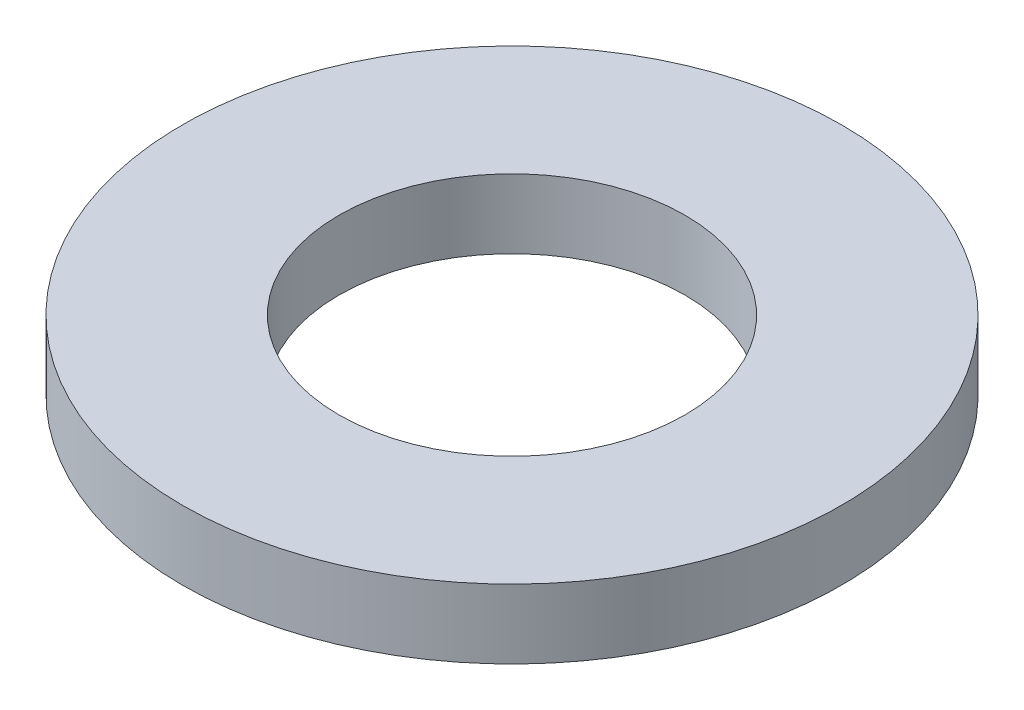
ISO-10303-21;
HEADER;
FILE_DESCRIPTION(('STEP AP214'),'2;1');
FILE_NAME('part.step','',(''),(''),'','','');
FILE_SCHEMA(('AUTOMOTIVE_DESIGN { 1 0 10303 214 1 1 1 1 }'));
ENDSEC;
DATA;
#1=APPLICATION_CONTEXT('core data for automotive mechanical design processes');
#2=APPLICATION_PROTOCOL_DEFINITION('international standard','automotive_design',2000,#1);
#3=PRODUCT_CONTEXT('',#1,'mechanical');
#4=PRODUCT('Part','Part','',(#3));
#5=PRODUCT_RELATED_PRODUCT_CATEGORY('part','',(#4));
#6=PRODUCT_DEFINITION_FORMATION('','',#4);
#7=PRODUCT_DEFINITION_CONTEXT('part definition',#1,'design');
#8=PRODUCT_DEFINITION('design','',#6,#7);
#9=PRODUCT_DEFINITION_SHAPE('','',#8);
#10=(LENGTH_UNIT() NAMED_UNIT(*) SI_UNIT(.MILLI.,.METRE.));
#11=(NAMED_UNIT(*) PLANE_ANGLE_UNIT() SI_UNIT($,.RADIAN.));
#12=(NAMED_UNIT(*) SI_UNIT($,.STERADIAN.) SOLID_ANGLE_UNIT());
#13=UNCERTAINTY_MEASURE_WITH_UNIT(LENGTH_MEASURE(1.E-05),#10,'distance_accuracy_value','');
#14=(GEOMETRIC_REPRESENTATION_CONTEXT(3) GLOBAL_UNCERTAINTY_ASSIGNED_CONTEXT((#13)) GLOBAL_UNIT_ASSIGNED_CONTEXT((#10,
#11,#12)) REPRESENTATION_CONTEXT('',''));
#15=CARTESIAN_POINT('',(0.,0.,0.));
#16=DIRECTION('',(0.,0.,1.));
#17=DIRECTION('',(1.,0.,0.));
#18=AXIS2_PLACEMENT_3D('',#15,#16,#17);
#19=CARTESIAN_POINT('',(0.,1.,0.));
#20=DIRECTION('',(0.,1.,0.));
#21=DIRECTION('',(0.,0.,1.));
#22=AXIS2_PLACEMENT_3D('',#19,#20,#21);
#23=PLANE('',#22);
#24=CARTESIAN_POINT('',(0.,1.,0.));
#25=DIRECTION('',(0.,1.,0.));
#26=DIRECTION('',(0.,0.,1.));
#27=AXIS2_PLACEMENT_3D('',#24,#25,#26);
#28=CIRCLE('',#27,4.7625);
#29=CARTESIAN_POINT('',(0.,1.,4.7625));
#30=VERTEX_POINT('',#29);
#31=EDGE_CURVE('E10',#30,#30,#28,.T.);
#32=ORIENTED_EDGE('',*,*,#31,.T.);
#33=EDGE_LOOP('',(#32));
#34=FACE_BOUND('',#33,.T.);
#35=CARTESIAN_POINT('',(0.,1.,0.));
#36=DIRECTION('',(0.,1.,0.));
#37=DIRECTION('',(0.,0.,1.));
#38=AXIS2_PLACEMENT_3D('',#35,#36,#37);
#39=CIRCLE('',#38,2.499999953);
#40=CARTESIAN_POINT('',(0.,1.,2.499999953));
#41=VERTEX_POINT('',#40);
#42=EDGE_CURVE('E46',#41,#41,#39,.T.);
#43=ORIENTED_EDGE('',*,*,#42,.F.);
#44=EDGE_LOOP('',(#43));
#45=FACE_BOUND('',#44,.T.);
#46=ADVANCED_FACE('F35',(#34,#45),#23,.T.);
#47=CARTESIAN_POINT('',(0.,0.,0.));
#48=DIRECTION('',(0.,1.,0.));
#49=DIRECTION('',(0.,0.,1.));
#50=AXIS2_PLACEMENT_3D('',#47,#48,#49);
#51=PLANE('',#50);
#52=CARTESIAN_POINT('',(0.,0.,0.));
#53=DIRECTION('',(0.,1.,0.));
#54=DIRECTION('',(0.,0.,1.));
#55=AXIS2_PLACEMENT_3D('',#52,#53,#54);
#56=CIRCLE('',#55,4.7625);
#57=CARTESIAN_POINT('',(0.,0.,4.7625));
#58=VERTEX_POINT('',#57);
#59=EDGE_CURVE('E39',#58,#58,#56,.T.);
#60=ORIENTED_EDGE('',*,*,#59,.F.);
#61=EDGE_LOOP('',(#60));
#62=FACE_BOUND('',#61,.T.);
#63=CARTESIAN_POINT('',(0.,0.,0.));
#64=DIRECTION('',(0.,1.,0.));
#65=DIRECTION('',(0.,0.,1.));
#66=AXIS2_PLACEMENT_3D('',#63,#64,#65);
#67=CIRCLE('',#66,2.499999953);
#68=CARTESIAN_POINT('',(0.,0.,2.499999953));
#69=VERTEX_POINT('',#68);
#70=EDGE_CURVE('E48',#69,#69,#67,.T.);
#71=ORIENTED_EDGE('',*,*,#70,.T.);
#72=EDGE_LOOP('',(#71));
#73=FACE_BOUND('',#72,.T.);
#74=ADVANCED_FACE('F58',(#62,#73),#51,.F.);
#75=CARTESIAN_POINT('',(0.,1.,0.));
#76=DIRECTION('',(0.,-1.,0.));
#77=DIRECTION('',(0.,0.,-1.));
#78=AXIS2_PLACEMENT_3D('',#75,#76,#77);
#79=CYLINDRICAL_SURFACE('',#78,4.7625);
#80=ORIENTED_EDGE('',*,*,#31,.F.);
#81=EDGE_LOOP('',(#80));
#82=FACE_BOUND('',#81,.T.);
#83=ORIENTED_EDGE('',*,*,#59,.T.);
#84=EDGE_LOOP('',(#83));
#85=FACE_BOUND('',#84,.T.);
#86=ADVANCED_FACE('F37',(#82,#85),#79,.T.);
#87=CARTESIAN_POINT('',(0.,1.,0.));
#88=DIRECTION('',(0.,-1.,0.));
#89=DIRECTION('',(0.,0.,-1.));
#90=AXIS2_PLACEMENT_3D('',#87,#88,#89);
#91=CYLINDRICAL_SURFACE('',#90,2.499999953);
#92=ORIENTED_EDGE('',*,*,#42,.T.);
#93=EDGE_LOOP('',(#92));
#94=FACE_BOUND('',#93,.T.);
#95=ORIENTED_EDGE('',*,*,#70,.F.);
#96=EDGE_LOOP('',(#95));
#97=FACE_BOUND('',#96,.T.);
#98=ADVANCED_FACE('F54',(#94,#97),#91,.F.);
#99=CLOSED_SHELL('',(#46,#74,#86,#98));
#100=MANIFOLD_SOLID_BREP('B2',#99);
#101=ADVANCED_BREP_SHAPE_REPRESENTATION('',(#18,#100),#14);
#102=SHAPE_DEFINITION_REPRESENTATION(#9,#101);
ENDSEC;
END-ISO-10303-21;
